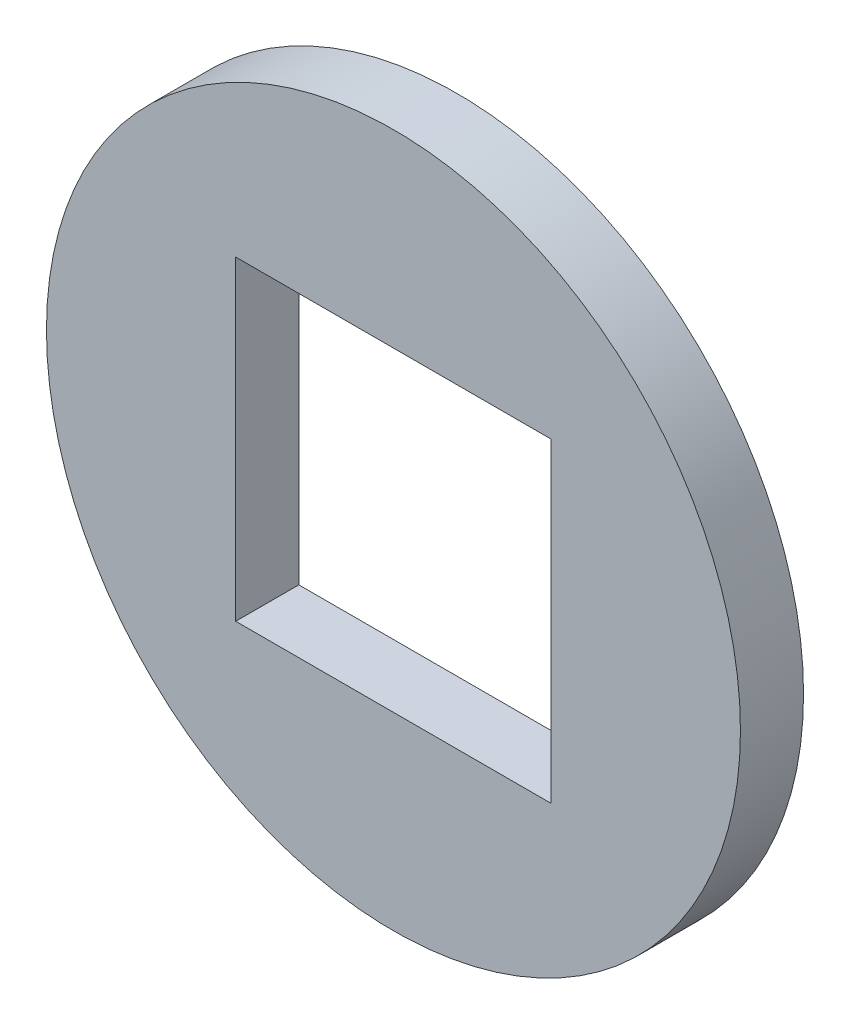
ISO-10303-21;
HEADER;
FILE_DESCRIPTION(('STEP AP214'),'2;1');
FILE_NAME('part.step','',(''),(''),'','','');
FILE_SCHEMA(('AUTOMOTIVE_DESIGN { 1 0 10303 214 1 1 1 1 }'));
ENDSEC;
DATA;
#1=APPLICATION_CONTEXT('core data for automotive mechanical design processes');
#2=APPLICATION_PROTOCOL_DEFINITION('international standard','automotive_design',2000,#1);
#3=PRODUCT_CONTEXT('',#1,'mechanical');
#4=PRODUCT('Part','Part','',(#3));
#5=PRODUCT_RELATED_PRODUCT_CATEGORY('part','',(#4));
#6=PRODUCT_DEFINITION_FORMATION('','',#4);
#7=PRODUCT_DEFINITION_CONTEXT('part definition',#1,'design');
#8=PRODUCT_DEFINITION('design','',#6,#7);
#9=PRODUCT_DEFINITION_SHAPE('','',#8);
#10=(LENGTH_UNIT() NAMED_UNIT(*) SI_UNIT(.MILLI.,.METRE.));
#11=(NAMED_UNIT(*) PLANE_ANGLE_UNIT() SI_UNIT($,.RADIAN.));
#12=(NAMED_UNIT(*) SI_UNIT($,.STERADIAN.) SOLID_ANGLE_UNIT());
#13=UNCERTAINTY_MEASURE_WITH_UNIT(LENGTH_MEASURE(1.E-05),#10,'distance_accuracy_value','');
#14=(GEOMETRIC_REPRESENTATION_CONTEXT(3) GLOBAL_UNCERTAINTY_ASSIGNED_CONTEXT((#13)) GLOBAL_UNIT_ASSIGNED_CONTEXT((#10,
#11,#12)) REPRESENTATION_CONTEXT('',''));
#15=CARTESIAN_POINT('',(0.,0.,0.));
#16=DIRECTION('',(0.,0.,1.));
#17=DIRECTION('',(1.,0.,0.));
#18=AXIS2_PLACEMENT_3D('',#15,#16,#17);
#19=CARTESIAN_POINT('',(0.,0.,2.));
#20=DIRECTION('',(0.,0.,1.));
#21=DIRECTION('',(1.,0.,0.));
#22=AXIS2_PLACEMENT_3D('',#19,#20,#21);
#23=PLANE('',#22);
#24=CARTESIAN_POINT('',(0.,0.,2.));
#25=DIRECTION('',(0.,0.,1.));
#26=DIRECTION('',(1.,0.,0.));
#27=AXIS2_PLACEMENT_3D('',#24,#25,#26);
#28=CIRCLE('',#27,11.);
#29=CARTESIAN_POINT('',(11.,0.,2.));
#30=VERTEX_POINT('',#29);
#31=EDGE_CURVE('E11',#30,#30,#28,.T.);
#32=ORIENTED_EDGE('',*,*,#31,.T.);
#33=EDGE_LOOP('',(#32));
#34=FACE_BOUND('',#33,.T.);
#35=DIRECTION('',(-1.,0.,0.));
#36=VECTOR('',#35,1.);
#37=CARTESIAN_POINT('',(-5.,5.,2.));
#38=LINE('',#37,#36);
#39=CARTESIAN_POINT('',(5.,5.,2.));
#40=VERTEX_POINT('',#39);
#41=CARTESIAN_POINT('',(-5.,5.,2.));
#42=VERTEX_POINT('',#41);
#43=EDGE_CURVE('E82',#40,#42,#38,.T.);
#44=ORIENTED_EDGE('',*,*,#43,.F.);
#45=DIRECTION('',(0.,1.,0.));
#46=VECTOR('',#45,1.);
#47=CARTESIAN_POINT('',(5.,-5.,2.));
#48=LINE('',#47,#46);
#49=CARTESIAN_POINT('',(5.,-5.,2.));
#50=VERTEX_POINT('',#49);
#51=EDGE_CURVE('E74',#50,#40,#48,.T.);
#52=ORIENTED_EDGE('',*,*,#51,.F.);
#53=DIRECTION('',(1.,0.,0.));
#54=VECTOR('',#53,1.);
#55=CARTESIAN_POINT('',(-5.,-5.,2.));
#56=LINE('',#55,#54);
#57=CARTESIAN_POINT('',(-5.,-5.,2.));
#58=VERTEX_POINT('',#57);
#59=EDGE_CURVE('E95',#58,#50,#56,.T.);
#60=ORIENTED_EDGE('',*,*,#59,.F.);
#61=DIRECTION('',(0.,-1.,0.));
#62=VECTOR('',#61,1.);
#63=CARTESIAN_POINT('',(-5.,-5.,2.));
#64=LINE('',#63,#62);
#65=EDGE_CURVE('E93',#42,#58,#64,.T.);
#66=ORIENTED_EDGE('',*,*,#65,.F.);
#67=EDGE_LOOP('',(#44,#52,#60,#66));
#68=FACE_BOUND('',#67,.T.);
#69=ADVANCED_FACE('F33',(#34,#68),#23,.T.);
#70=CARTESIAN_POINT('',(0.,0.,0.));
#71=DIRECTION('',(0.,0.,1.));
#72=DIRECTION('',(1.,0.,0.));
#73=AXIS2_PLACEMENT_3D('',#70,#71,#72);
#74=PLANE('',#73);
#75=CARTESIAN_POINT('',(0.,0.,0.));
#76=DIRECTION('',(0.,0.,1.));
#77=DIRECTION('',(1.,0.,0.));
#78=AXIS2_PLACEMENT_3D('',#75,#76,#77);
#79=CIRCLE('',#78,11.);
#80=CARTESIAN_POINT('',(11.,0.,0.));
#81=VERTEX_POINT('',#80);
#82=EDGE_CURVE('E37',#81,#81,#79,.T.);
#83=ORIENTED_EDGE('',*,*,#82,.F.);
#84=EDGE_LOOP('',(#83));
#85=FACE_BOUND('',#84,.T.);
#86=DIRECTION('',(0.,1.,0.));
#87=VECTOR('',#86,1.);
#88=CARTESIAN_POINT('',(5.,-5.,0.));
#89=LINE('',#88,#87);
#90=CARTESIAN_POINT('',(5.,-5.,0.));
#91=VERTEX_POINT('',#90);
#92=CARTESIAN_POINT('',(5.,5.,0.));
#93=VERTEX_POINT('',#92);
#94=EDGE_CURVE('E56',#91,#93,#89,.T.);
#95=ORIENTED_EDGE('',*,*,#94,.T.);
#96=DIRECTION('',(-1.,0.,0.));
#97=VECTOR('',#96,1.);
#98=CARTESIAN_POINT('',(-5.,5.,0.));
#99=LINE('',#98,#97);
#100=CARTESIAN_POINT('',(-5.,5.,0.));
#101=VERTEX_POINT('',#100);
#102=EDGE_CURVE('E89',#93,#101,#99,.T.);
#103=ORIENTED_EDGE('',*,*,#102,.T.);
#104=DIRECTION('',(0.,-1.,0.));
#105=VECTOR('',#104,1.);
#106=CARTESIAN_POINT('',(-5.,-5.,0.));
#107=LINE('',#106,#105);
#108=CARTESIAN_POINT('',(-5.,-5.,0.));
#109=VERTEX_POINT('',#108);
#110=EDGE_CURVE('E101',#101,#109,#107,.T.);
#111=ORIENTED_EDGE('',*,*,#110,.T.);
#112=DIRECTION('',(1.,0.,0.));
#113=VECTOR('',#112,1.);
#114=CARTESIAN_POINT('',(-5.,-5.,0.));
#115=LINE('',#114,#113);
#116=EDGE_CURVE('E83',#109,#91,#115,.T.);
#117=ORIENTED_EDGE('',*,*,#116,.T.);
#118=EDGE_LOOP('',(#95,#103,#111,#117));
#119=FACE_BOUND('',#118,.T.);
#120=ADVANCED_FACE('F112',(#85,#119),#74,.F.);
#121=CARTESIAN_POINT('',(0.,0.,2.));
#122=DIRECTION('',(0.,0.,-1.));
#123=DIRECTION('',(-1.,0.,0.));
#124=AXIS2_PLACEMENT_3D('',#121,#122,#123);
#125=CYLINDRICAL_SURFACE('',#124,11.);
#126=ORIENTED_EDGE('',*,*,#31,.F.);
#127=EDGE_LOOP('',(#126));
#128=FACE_BOUND('',#127,.T.);
#129=ORIENTED_EDGE('',*,*,#82,.T.);
#130=EDGE_LOOP('',(#129));
#131=FACE_BOUND('',#130,.T.);
#132=ADVANCED_FACE('F35',(#128,#131),#125,.T.);
#133=CARTESIAN_POINT('',(5.,-5.,2.));
#134=DIRECTION('',(-1.,0.,0.));
#135=DIRECTION('',(0.,0.,1.));
#136=AXIS2_PLACEMENT_3D('',#133,#134,#135);
#137=PLANE('',#136);
#138=ORIENTED_EDGE('',*,*,#94,.F.);
#139=DIRECTION('',(0.,0.,-1.));
#140=VECTOR('',#139,1.);
#141=CARTESIAN_POINT('',(5.,-5.,2.));
#142=LINE('',#141,#140);
#143=EDGE_CURVE('E78',#50,#91,#142,.T.);
#144=ORIENTED_EDGE('',*,*,#143,.F.);
#145=ORIENTED_EDGE('',*,*,#51,.T.);
#146=DIRECTION('',(0.,0.,-1.));
#147=VECTOR('',#146,1.);
#148=CARTESIAN_POINT('',(5.,5.,2.));
#149=LINE('',#148,#147);
#150=EDGE_CURVE('E77',#40,#93,#149,.T.);
#151=ORIENTED_EDGE('',*,*,#150,.T.);
#152=EDGE_LOOP('',(#138,#144,#145,#151));
#153=FACE_BOUND('',#152,.T.);
#154=ADVANCED_FACE('F76',(#153),#137,.T.);
#155=CARTESIAN_POINT('',(-5.,5.,2.));
#156=DIRECTION('',(0.,-1.,0.));
#157=DIRECTION('',(0.,0.,-1.));
#158=AXIS2_PLACEMENT_3D('',#155,#156,#157);
#159=PLANE('',#158);
#160=ORIENTED_EDGE('',*,*,#102,.F.);
#161=ORIENTED_EDGE('',*,*,#150,.F.);
#162=ORIENTED_EDGE('',*,*,#43,.T.);
#163=DIRECTION('',(0.,0.,-1.));
#164=VECTOR('',#163,1.);
#165=CARTESIAN_POINT('',(-5.,5.,2.));
#166=LINE('',#165,#164);
#167=EDGE_CURVE('E90',#42,#101,#166,.T.);
#168=ORIENTED_EDGE('',*,*,#167,.T.);
#169=EDGE_LOOP('',(#160,#161,#162,#168));
#170=FACE_BOUND('',#169,.T.);
#171=ADVANCED_FACE('F86',(#170),#159,.T.);
#172=CARTESIAN_POINT('',(-5.,-5.,2.));
#173=DIRECTION('',(1.,0.,0.));
#174=DIRECTION('',(0.,0.,-1.));
#175=AXIS2_PLACEMENT_3D('',#172,#173,#174);
#176=PLANE('',#175);
#177=ORIENTED_EDGE('',*,*,#110,.F.);
#178=ORIENTED_EDGE('',*,*,#167,.F.);
#179=ORIENTED_EDGE('',*,*,#65,.T.);
#180=DIRECTION('',(0.,0.,-1.));
#181=VECTOR('',#180,1.);
#182=CARTESIAN_POINT('',(-5.,-5.,2.));
#183=LINE('',#182,#181);
#184=EDGE_CURVE('E48',#58,#109,#183,.T.);
#185=ORIENTED_EDGE('',*,*,#184,.T.);
#186=EDGE_LOOP('',(#177,#178,#179,#185));
#187=FACE_BOUND('',#186,.T.);
#188=ADVANCED_FACE('F110',(#187),#176,.T.);
#189=CARTESIAN_POINT('',(-5.,-5.,2.));
#190=DIRECTION('',(0.,1.,0.));
#191=DIRECTION('',(0.,0.,1.));
#192=AXIS2_PLACEMENT_3D('',#189,#190,#191);
#193=PLANE('',#192);
#194=ORIENTED_EDGE('',*,*,#116,.F.);
#195=ORIENTED_EDGE('',*,*,#184,.F.);
#196=ORIENTED_EDGE('',*,*,#59,.T.);
#197=ORIENTED_EDGE('',*,*,#143,.T.);
#198=EDGE_LOOP('',(#194,#195,#196,#197));
#199=FACE_BOUND('',#198,.T.);
#200=ADVANCED_FACE('F113',(#199),#193,.T.);
#201=CLOSED_SHELL('',(#69,#120,#132,#154,#171,#188,#200));
#202=MANIFOLD_SOLID_BREP('B2',#201);
#203=ADVANCED_BREP_SHAPE_REPRESENTATION('',(#18,#202),#14);
#204=SHAPE_DEFINITION_REPRESENTATION(#9,#203);
ENDSEC;
END-ISO-10303-21;
